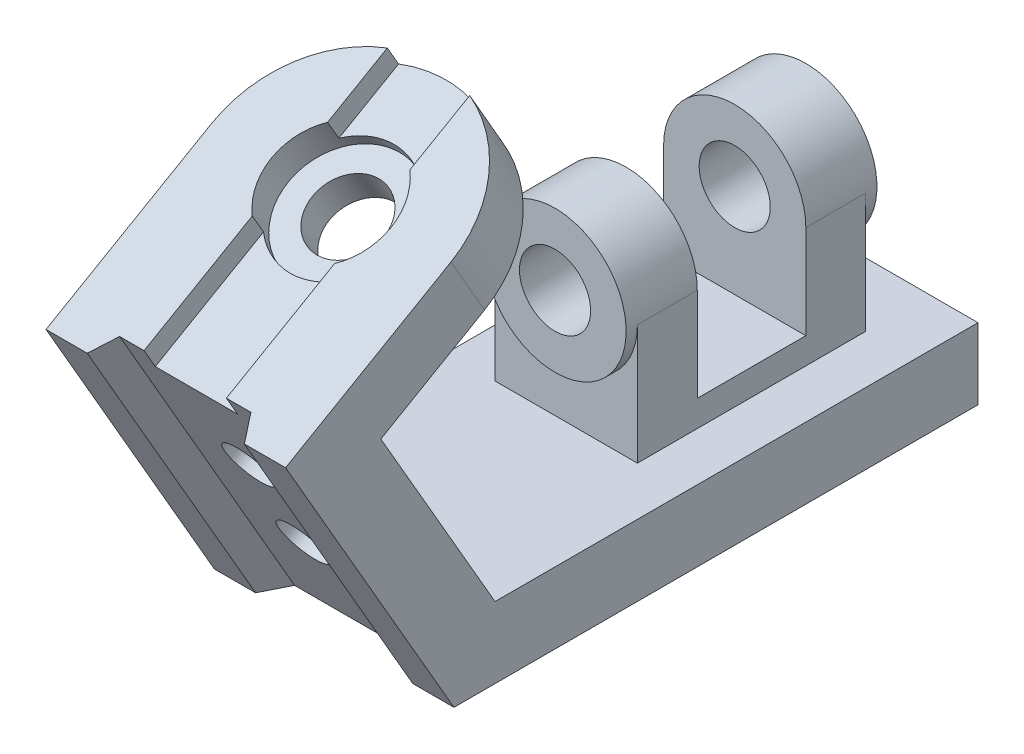
ISO-10303-21;
HEADER;
FILE_DESCRIPTION(('STEP AP214'),'2;1');
FILE_NAME('part.step','',(''),(''),'','','');
FILE_SCHEMA(('AUTOMOTIVE_DESIGN { 1 0 10303 214 1 1 1 1 }'));
ENDSEC;
DATA;
#1=APPLICATION_CONTEXT('core data for automotive mechanical design processes');
#2=APPLICATION_PROTOCOL_DEFINITION('international standard','automotive_design',2000,#1);
#3=PRODUCT_CONTEXT('',#1,'mechanical');
#4=PRODUCT('Part','Part','',(#3));
#5=PRODUCT_RELATED_PRODUCT_CATEGORY('part','',(#4));
#6=PRODUCT_DEFINITION_FORMATION('','',#4);
#7=PRODUCT_DEFINITION_CONTEXT('part definition',#1,'design');
#8=PRODUCT_DEFINITION('design','',#6,#7);
#9=PRODUCT_DEFINITION_SHAPE('','',#8);
#10=(LENGTH_UNIT() NAMED_UNIT(*) SI_UNIT(.MILLI.,.METRE.));
#11=(NAMED_UNIT(*) PLANE_ANGLE_UNIT() SI_UNIT($,.RADIAN.));
#12=(NAMED_UNIT(*) SI_UNIT($,.STERADIAN.) SOLID_ANGLE_UNIT());
#13=UNCERTAINTY_MEASURE_WITH_UNIT(LENGTH_MEASURE(1.E-05),#10,'distance_accuracy_value','');
#14=(GEOMETRIC_REPRESENTATION_CONTEXT(3) GLOBAL_UNCERTAINTY_ASSIGNED_CONTEXT((#13)) GLOBAL_UNIT_ASSIGNED_CONTEXT((#10,
#11,#12)) REPRESENTATION_CONTEXT('',''));
#15=CARTESIAN_POINT('',(0.,0.,0.));
#16=DIRECTION('',(0.,0.,1.));
#17=DIRECTION('',(1.,0.,0.));
#18=AXIS2_PLACEMENT_3D('',#15,#16,#17);
#19=CARTESIAN_POINT('',(0.,51.,-62.));
#20=DIRECTION('',(0.,0.,-1.));
#21=DIRECTION('',(-1.,0.,0.));
#22=AXIS2_PLACEMENT_3D('',#19,#20,#21);
#23=CYLINDRICAL_SURFACE('',#22,19.);
#24=CARTESIAN_POINT('',(0.,51.,-107.));
#25=DIRECTION('',(0.,0.,-1.));
#26=DIRECTION('',(-1.,0.,0.));
#27=AXIS2_PLACEMENT_3D('',#24,#25,#26);
#28=CIRCLE('',#27,19.);
#29=CARTESIAN_POINT('',(19.,51.,-107.));
#30=VERTEX_POINT('',#29);
#31=CARTESIAN_POINT('',(-19.,51.,-107.));
#32=VERTEX_POINT('',#31);
#33=EDGE_CURVE('E254',#30,#32,#28,.F.);
#34=ORIENTED_EDGE('',*,*,#33,.F.);
#35=DIRECTION('',(0.,0.,-1.));
#36=VECTOR('',#35,1.);
#37=CARTESIAN_POINT('',(19.,51.,-62.));
#38=LINE('',#37,#36);
#39=CARTESIAN_POINT('',(19.,51.,-123.));
#40=VERTEX_POINT('',#39);
#41=EDGE_CURVE('E296',#30,#40,#38,.T.);
#42=ORIENTED_EDGE('',*,*,#41,.T.);
#43=CARTESIAN_POINT('',(0.,51.,-123.));
#44=DIRECTION('',(0.,0.,-1.));
#45=DIRECTION('',(-1.,0.,0.));
#46=AXIS2_PLACEMENT_3D('',#43,#44,#45);
#47=CIRCLE('',#46,19.);
#48=CARTESIAN_POINT('',(-19.,51.,-123.));
#49=VERTEX_POINT('',#48);
#50=EDGE_CURVE('E11',#40,#49,#47,.T.);
#51=ORIENTED_EDGE('',*,*,#50,.T.);
#52=DIRECTION('',(0.,0.,-1.));
#53=VECTOR('',#52,1.);
#54=CARTESIAN_POINT('',(-19.,51.,-62.));
#55=LINE('',#54,#53);
#56=EDGE_CURVE('E284',#32,#49,#55,.T.);
#57=ORIENTED_EDGE('',*,*,#56,.F.);
#58=EDGE_LOOP('',(#34,#42,#51,#57));
#59=FACE_BOUND('',#58,.T.);
#60=CARTESIAN_POINT('',(0.,51.,-126.));
#61=DIRECTION('',(0.,0.,-1.));
#62=DIRECTION('',(-1.,0.,0.));
#63=AXIS2_PLACEMENT_3D('',#60,#61,#62);
#64=CIRCLE('',#63,19.);
#65=CARTESIAN_POINT('',(-19.,51.,-126.));
#66=VERTEX_POINT('',#65);
#67=EDGE_CURVE('E266',#66,#66,#64,.T.);
#68=ORIENTED_EDGE('',*,*,#67,.F.);
#69=EDGE_LOOP('',(#68));
#70=FACE_BOUND('',#69,.T.);
#71=ADVANCED_FACE('F32',(#59,#70),#23,.T.);
#72=CARTESIAN_POINT('',(0.,51.,-32.1299423149112));
#73=DIRECTION('',(0.,0.,-1.));
#74=DIRECTION('',(-1.,0.,0.));
#75=AXIS2_PLACEMENT_3D('',#72,#73,#74);
#76=CYLINDRICAL_SURFACE('',#75,9.5);
#77=CARTESIAN_POINT('',(0.,51.,-107.));
#78=DIRECTION('',(0.,0.,-1.));
#79=DIRECTION('',(-1.,0.,0.));
#80=AXIS2_PLACEMENT_3D('',#77,#78,#79);
#81=CIRCLE('',#80,9.5);
#82=CARTESIAN_POINT('',(-9.5,51.,-107.));
#83=VERTEX_POINT('',#82);
#84=EDGE_CURVE('E36',#83,#83,#81,.F.);
#85=ORIENTED_EDGE('',*,*,#84,.T.);
#86=EDGE_LOOP('',(#85));
#87=FACE_BOUND('',#86,.T.);
#88=CARTESIAN_POINT('',(0.,51.,-126.));
#89=DIRECTION('',(0.,0.,-1.));
#90=DIRECTION('',(-1.,0.,0.));
#91=AXIS2_PLACEMENT_3D('',#88,#89,#90);
#92=CIRCLE('',#91,9.5);
#93=CARTESIAN_POINT('',(-9.5,51.,-126.));
#94=VERTEX_POINT('',#93);
#95=EDGE_CURVE('E260',#94,#94,#92,.T.);
#96=ORIENTED_EDGE('',*,*,#95,.T.);
#97=EDGE_LOOP('',(#96));
#98=FACE_BOUND('',#97,.T.);
#99=ADVANCED_FACE('F476',(#87,#98),#76,.F.);
#100=CARTESIAN_POINT('',(32.,19.,-201.566981764822));
#101=DIRECTION('',(0.,-1.,0.));
#102=DIRECTION('',(0.,0.,-1.));
#103=AXIS2_PLACEMENT_3D('',#100,#101,#102);
#104=PLANE('',#103);
#105=DIRECTION('',(0.,0.,1.));
#106=VECTOR('',#105,1.);
#107=CARTESIAN_POINT('',(-32.,19.,-201.566981764822));
#108=LINE('',#107,#106);
#109=CARTESIAN_POINT('',(-32.,19.,-140.));
#110=VERTEX_POINT('',#109);
#111=CARTESIAN_POINT('',(-32.,19.,-10.9696551146029));
#112=VERTEX_POINT('',#111);
#113=EDGE_CURVE('E433',#110,#112,#108,.T.);
#114=ORIENTED_EDGE('',*,*,#113,.T.);
#115=DIRECTION('',(-1.,0.,0.));
#116=VECTOR('',#115,1.);
#117=CARTESIAN_POINT('',(32.,19.,-10.9696551146029));
#118=LINE('',#117,#116);
#119=CARTESIAN_POINT('',(32.,19.,-10.9696551146029));
#120=VERTEX_POINT('',#119);
#121=EDGE_CURVE('E443',#120,#112,#118,.T.);
#122=ORIENTED_EDGE('',*,*,#121,.F.);
#123=DIRECTION('',(0.,0.,1.));
#124=VECTOR('',#123,1.);
#125=CARTESIAN_POINT('',(32.,19.,-201.566981764822));
#126=LINE('',#125,#124);
#127=CARTESIAN_POINT('',(32.,19.,-140.));
#128=VERTEX_POINT('',#127);
#129=EDGE_CURVE('E419',#128,#120,#126,.T.);
#130=ORIENTED_EDGE('',*,*,#129,.F.);
#131=DIRECTION('',(-1.,0.,0.));
#132=VECTOR('',#131,1.);
#133=CARTESIAN_POINT('',(32.,19.,-140.));
#134=LINE('',#133,#132);
#135=EDGE_CURVE('E446',#128,#110,#134,.T.);
#136=ORIENTED_EDGE('',*,*,#135,.T.);
#137=EDGE_LOOP('',(#114,#122,#130,#136));
#138=FACE_BOUND('',#137,.T.);
#139=DIRECTION('',(-1.,0.,0.));
#140=VECTOR('',#139,1.);
#141=CARTESIAN_POINT('',(-49.6108563641288,19.,-62.));
#142=LINE('',#141,#140);
#143=CARTESIAN_POINT('',(19.,19.,-62.));
#144=VERTEX_POINT('',#143);
#145=CARTESIAN_POINT('',(-19.,19.,-62.));
#146=VERTEX_POINT('',#145);
#147=EDGE_CURVE('E281',#144,#146,#142,.T.);
#148=ORIENTED_EDGE('',*,*,#147,.T.);
#149=DIRECTION('',(0.,0.,-1.));
#150=VECTOR('',#149,1.);
#151=CARTESIAN_POINT('',(-19.,19.,-62.));
#152=LINE('',#151,#150);
#153=CARTESIAN_POINT('',(-19.,19.,-123.));
#154=VERTEX_POINT('',#153);
#155=EDGE_CURVE('E288',#146,#154,#152,.T.);
#156=ORIENTED_EDGE('',*,*,#155,.T.);
#157=DIRECTION('',(-1.,0.,0.));
#158=VECTOR('',#157,1.);
#159=CARTESIAN_POINT('',(-49.6108563641288,19.,-123.));
#160=LINE('',#159,#158);
#161=CARTESIAN_POINT('',(19.,19.,-123.));
#162=VERTEX_POINT('',#161);
#163=EDGE_CURVE('E278',#162,#154,#160,.T.);
#164=ORIENTED_EDGE('',*,*,#163,.F.);
#165=DIRECTION('',(0.,0.,-1.));
#166=VECTOR('',#165,1.);
#167=CARTESIAN_POINT('',(19.,19.,-62.));
#168=LINE('',#167,#166);
#169=EDGE_CURVE('E292',#144,#162,#168,.T.);
#170=ORIENTED_EDGE('',*,*,#169,.F.);
#171=EDGE_LOOP('',(#148,#156,#164,#170));
#172=FACE_BOUND('',#171,.T.);
#173=ADVANCED_FACE('F483',(#138,#172),#104,.F.);
#174=CARTESIAN_POINT('',(11.,96.4202115404301,0.995294735436678));
#175=DIRECTION('',(-1.,0.,0.));
#176=DIRECTION('',(0.,0.,1.));
#177=AXIS2_PLACEMENT_3D('',#174,#175,#176);
#178=PLANE('',#177);
#179=DIRECTION('',(0.,0.866025403784436,0.500000000000004));
#180=VECTOR('',#179,1.);
#181=CARTESIAN_POINT('',(11.,89.8385826872284,6.3950103057431));
#182=LINE('',#181,#180);
#183=CARTESIAN_POINT('',(11.,92.4366588985817,7.89501030574314));
#184=VERTEX_POINT('',#183);
#185=CARTESIAN_POINT('',(11.,97.6328113212883,10.8950103057431));
#186=VERTEX_POINT('',#185);
#187=EDGE_CURVE('E322',#184,#186,#182,.T.);
#188=ORIENTED_EDGE('',*,*,#187,.F.);
#189=DIRECTION('',(0.,-0.500000000000004,0.866025403784436));
#190=VECTOR('',#189,1.);
#191=CARTESIAN_POINT('',(11.,96.4202115404301,0.995294735436678));
#192=LINE('',#191,#190);
#193=CARTESIAN_POINT('',(11.,75.7461339178927,36.8038475772938));
#194=VERTEX_POINT('',#193);
#195=EDGE_CURVE('E341',#184,#194,#192,.T.);
#196=ORIENTED_EDGE('',*,*,#195,.T.);
#197=DIRECTION('',(0.,0.866025403784436,0.500000000000004));
#198=VECTOR('',#197,1.);
#199=CARTESIAN_POINT('',(11.,75.7461339178927,36.8038475772938));
#200=LINE('',#199,#198);
#201=CARTESIAN_POINT('',(11.,80.9422863405993,39.8038475772938));
#202=VERTEX_POINT('',#201);
#203=EDGE_CURVE('E356',#194,#202,#200,.T.);
#204=ORIENTED_EDGE('',*,*,#203,.T.);
#205=DIRECTION('',(0.,-0.500000000000004,0.866025403784436));
#206=VECTOR('',#205,1.);
#207=CARTESIAN_POINT('',(11.,101.616363963137,3.9952947354367));
#208=LINE('',#207,#206);
#209=EDGE_CURVE('E349',#186,#202,#208,.T.);
#210=ORIENTED_EDGE('',*,*,#209,.F.);
#211=EDGE_LOOP('',(#188,#196,#204,#210));
#212=FACE_BOUND('',#211,.T.);
#213=ADVANCED_FACE('F564',(#212),#178,.T.);
#214=CARTESIAN_POINT('',(-11.,96.4202115404301,0.995294735436677));
#215=DIRECTION('',(-1.,0.,0.));
#216=DIRECTION('',(0.,0.,1.));
#217=AXIS2_PLACEMENT_3D('',#214,#215,#216);
#218=PLANE('',#217);
#219=DIRECTION('',(0.,-0.500000000000004,0.866025403784436));
#220=VECTOR('',#219,1.);
#221=CARTESIAN_POINT('',(-11.,96.4202115404301,0.995294735436677));
#222=LINE('',#221,#220);
#223=CARTESIAN_POINT('',(-11.,92.4366588985817,7.89501030574314));
#224=VERTEX_POINT('',#223);
#225=CARTESIAN_POINT('',(-11.,75.7461339178927,36.8038475772938));
#226=VERTEX_POINT('',#225);
#227=EDGE_CURVE('E333',#224,#226,#222,.T.);
#228=ORIENTED_EDGE('',*,*,#227,.F.);
#229=DIRECTION('',(0.,0.866025403784436,0.500000000000004));
#230=VECTOR('',#229,1.);
#231=CARTESIAN_POINT('',(-11.,89.8385826872284,6.3950103057431));
#232=LINE('',#231,#230);
#233=CARTESIAN_POINT('',(-11.,97.6328113212883,10.8950103057431));
#234=VERTEX_POINT('',#233);
#235=EDGE_CURVE('E57',#224,#234,#232,.T.);
#236=ORIENTED_EDGE('',*,*,#235,.T.);
#237=DIRECTION('',(0.,-0.500000000000004,0.866025403784436));
#238=VECTOR('',#237,1.);
#239=CARTESIAN_POINT('',(-11.,101.616363963137,3.9952947354367));
#240=LINE('',#239,#238);
#241=CARTESIAN_POINT('',(-11.,80.9422863405993,39.8038475772938));
#242=VERTEX_POINT('',#241);
#243=EDGE_CURVE('E329',#234,#242,#240,.T.);
#244=ORIENTED_EDGE('',*,*,#243,.T.);
#245=DIRECTION('',(0.,0.866025403784436,0.500000000000004));
#246=VECTOR('',#245,1.);
#247=CARTESIAN_POINT('',(-11.,75.7461339178927,36.8038475772938));
#248=LINE('',#247,#246);
#249=EDGE_CURVE('E359',#226,#242,#248,.T.);
#250=ORIENTED_EDGE('',*,*,#249,.F.);
#251=EDGE_LOOP('',(#228,#236,#244,#250));
#252=FACE_BOUND('',#251,.T.);
#253=ADVANCED_FACE('F568',(#252),#218,.F.);
#254=CARTESIAN_POINT('',(-81.4542947755958,96.4202115404301,0.995294735436675));
#255=DIRECTION('',(0.,0.866025403784436,0.500000000000004));
#256=DIRECTION('',(0.,-0.500000000000004,0.866025403784436));
#257=AXIS2_PLACEMENT_3D('',#254,#255,#256);
#258=PLANE('',#257);
#259=CARTESIAN_POINT('',(0.,98.2461339178929,-2.16729559300588));
#260=DIRECTION('',(0.,0.866025403784436,0.500000000000004));
#261=DIRECTION('',(0.,-0.500000000000004,0.866025403784436));
#262=AXIS2_PLACEMENT_3D('',#259,#260,#261);
#263=CIRCLE('',#262,16.);
#264=CARTESIAN_POINT('',(11.,104.055608937204,-12.2296014917549));
#265=VERTEX_POINT('',#264);
#266=CARTESIAN_POINT('',(-11.,104.055608937204,-12.2296014917549));
#267=VERTEX_POINT('',#266);
#268=EDGE_CURVE('E41',#265,#267,#263,.T.);
#269=ORIENTED_EDGE('',*,*,#268,.F.);
#270=CARTESIAN_POINT('',(11.,113.27111311921,-28.191322952352));
#271=VERTEX_POINT('',#270);
#272=EDGE_CURVE('E342',#271,#265,#192,.T.);
#273=ORIENTED_EDGE('',*,*,#272,.F.);
#274=CARTESIAN_POINT('',(0.,98.2461339178929,-2.16729559300587));
#275=DIRECTION('',(0.,0.866025403784436,0.500000000000004));
#276=DIRECTION('',(0.,-0.500000000000004,0.866025403784436));
#277=AXIS2_PLACEMENT_3D('',#274,#275,#276);
#278=CIRCLE('',#277,32.);
#279=CARTESIAN_POINT('',(-11.,113.27111311921,-28.191322952352));
#280=VERTEX_POINT('',#279);
#281=EDGE_CURVE('E330',#271,#280,#278,.T.);
#282=ORIENTED_EDGE('',*,*,#281,.T.);
#283=EDGE_CURVE('E335',#280,#267,#222,.T.);
#284=ORIENTED_EDGE('',*,*,#283,.T.);
#285=EDGE_LOOP('',(#269,#273,#282,#284));
#286=FACE_BOUND('',#285,.T.);
#287=ADVANCED_FACE('F558',(#286),#258,.T.);
#288=CARTESIAN_POINT('',(32.,170.309231500771,-114.984241957343));
#289=DIRECTION('',(0.,0.866025403784436,0.500000000000004));
#290=DIRECTION('',(0.,-0.500000000000004,0.866025403784436));
#291=AXIS2_PLACEMENT_3D('',#288,#289,#290);
#292=PLANE('',#291);
#293=CARTESIAN_POINT('',(0.,103.442286340599,0.832704406994116));
#294=DIRECTION('',(0.,0.866025403784436,0.500000000000004));
#295=DIRECTION('',(0.,-0.500000000000004,0.866025403784436));
#296=AXIS2_PLACEMENT_3D('',#293,#294,#295);
#297=CIRCLE('',#296,16.);
#298=CARTESIAN_POINT('',(11.,109.251761359911,-9.22960149175491));
#299=VERTEX_POINT('',#298);
#300=EDGE_CURVE('E318',#186,#299,#297,.T.);
#301=ORIENTED_EDGE('',*,*,#300,.F.);
#302=ORIENTED_EDGE('',*,*,#209,.T.);
#303=DIRECTION('',(-1.,0.,0.));
#304=VECTOR('',#303,1.);
#305=CARTESIAN_POINT('',(-17.5358983848622,80.9422863405993,39.8038475772938));
#306=LINE('',#305,#304);
#307=CARTESIAN_POINT('',(17.5358983848622,80.9422863405993,39.8038475772938));
#308=VERTEX_POINT('',#307);
#309=EDGE_CURVE('E366',#308,#202,#306,.T.);
#310=ORIENTED_EDGE('',*,*,#309,.F.);
#311=DIRECTION('',(-0.500000000000005,0.433012701892221,-0.749999999999995));
#312=VECTOR('',#311,1.);
#313=CARTESIAN_POINT('',(17.5358983848622,80.9422863405993,39.8038475772938));
#314=LINE('',#313,#312);
#315=CARTESIAN_POINT('',(21.,77.9422863405993,45.0000000000004));
#316=VERTEX_POINT('',#315);
#317=EDGE_CURVE('E355',#316,#308,#314,.T.);
#318=ORIENTED_EDGE('',*,*,#317,.F.);
#319=DIRECTION('',(-1.,0.,0.));
#320=VECTOR('',#319,1.);
#321=CARTESIAN_POINT('',(32.,77.9422863405992,45.0000000000004));
#322=LINE('',#321,#320);
#323=CARTESIAN_POINT('',(32.,77.9422863405992,45.0000000000004));
#324=VERTEX_POINT('',#323);
#325=EDGE_CURVE('E440',#324,#316,#322,.T.);
#326=ORIENTED_EDGE('',*,*,#325,.F.);
#327=DIRECTION('',(0.,0.500000000000004,-0.866025403784436));
#328=VECTOR('',#327,1.);
#329=CARTESIAN_POINT('',(32.,170.309231500771,-114.984241957343));
#330=LINE('',#329,#328);
#331=CARTESIAN_POINT('',(32.,103.442286340599,0.83270440699411));
#332=VERTEX_POINT('',#331);
#333=EDGE_CURVE('E424',#324,#332,#330,.T.);
#334=ORIENTED_EDGE('',*,*,#333,.T.);
#335=CARTESIAN_POINT('',(0.,103.442286340599,0.832704406994123));
#336=DIRECTION('',(0.,0.866025403784436,0.500000000000004));
#337=DIRECTION('',(0.,-0.500000000000004,0.866025403784436));
#338=AXIS2_PLACEMENT_3D('',#335,#336,#337);
#339=CIRCLE('',#338,32.);
#340=CARTESIAN_POINT('',(11.,118.467265541916,-25.191322952352));
#341=VERTEX_POINT('',#340);
#342=EDGE_CURVE('E394',#332,#341,#339,.T.);
#343=ORIENTED_EDGE('',*,*,#342,.T.);
#344=EDGE_CURVE('E334',#341,#299,#208,.T.);
#345=ORIENTED_EDGE('',*,*,#344,.T.);
#346=EDGE_LOOP('',(#301,#302,#310,#318,#326,#334,#343,#345));
#347=FACE_BOUND('',#346,.T.);
#348=ADVANCED_FACE('F589',(#347),#292,.T.);
#349=CARTESIAN_POINT('',(0.,87.8538290724796,-8.16729559300595));
#350=DIRECTION('',(0.,0.866025403784436,0.500000000000004));
#351=DIRECTION('',(0.,-0.500000000000004,0.866025403784436));
#352=AXIS2_PLACEMENT_3D('',#349,#350,#351);
#353=CYLINDRICAL_SURFACE('',#352,32.);
#354=ORIENTED_EDGE('',*,*,#281,.F.);
#355=DIRECTION('',(0.,0.866025403784436,0.500000000000004));
#356=VECTOR('',#355,1.);
#357=CARTESIAN_POINT('',(11.,113.27111311921,-28.191322952352));
#358=LINE('',#357,#356);
#359=EDGE_CURVE('E352',#271,#341,#358,.T.);
#360=ORIENTED_EDGE('',*,*,#359,.T.);
#361=ORIENTED_EDGE('',*,*,#342,.F.);
#362=DIRECTION('',(0.,0.866025403784436,0.500000000000004));
#363=VECTOR('',#362,1.);
#364=CARTESIAN_POINT('',(32.,87.8538290724796,-8.16729559300596));
#365=LINE('',#364,#363);
#366=CARTESIAN_POINT('',(32.,87.8538290724796,-8.16729559300596));
#367=VERTEX_POINT('',#366);
#368=EDGE_CURVE('E400',#367,#332,#365,.T.);
#369=ORIENTED_EDGE('',*,*,#368,.F.);
#370=CARTESIAN_POINT('',(0.,87.8538290724796,-8.16729559300595));
#371=DIRECTION('',(0.,0.866025403784436,0.500000000000004));
#372=DIRECTION('',(0.,-0.500000000000004,0.866025403784436));
#373=AXIS2_PLACEMENT_3D('',#370,#371,#372);
#374=CIRCLE('',#373,32.);
#375=CARTESIAN_POINT('',(-32.,87.8538290724796,-8.16729559300594));
#376=VERTEX_POINT('',#375);
#377=EDGE_CURVE('E393',#367,#376,#374,.T.);
#378=ORIENTED_EDGE('',*,*,#377,.T.);
#379=DIRECTION('',(0.,0.866025403784436,0.500000000000004));
#380=VECTOR('',#379,1.);
#381=CARTESIAN_POINT('',(-32.,87.8538290724796,-8.16729559300594));
#382=LINE('',#381,#380);
#383=CARTESIAN_POINT('',(-32.,103.442286340599,0.832704406994133));
#384=VERTEX_POINT('',#383);
#385=EDGE_CURVE('E403',#376,#384,#382,.T.);
#386=ORIENTED_EDGE('',*,*,#385,.T.);
#387=CARTESIAN_POINT('',(-11.,118.467265541916,-25.191322952352));
#388=VERTEX_POINT('',#387);
#389=EDGE_CURVE('E390',#388,#384,#339,.T.);
#390=ORIENTED_EDGE('',*,*,#389,.F.);
#391=DIRECTION('',(0.,0.866025403784436,0.500000000000004));
#392=VECTOR('',#391,1.);
#393=CARTESIAN_POINT('',(-11.,113.27111311921,-28.191322952352));
#394=LINE('',#393,#392);
#395=EDGE_CURVE('E345',#280,#388,#394,.T.);
#396=ORIENTED_EDGE('',*,*,#395,.F.);
#397=EDGE_LOOP('',(#354,#360,#361,#369,#378,#386,#390,#396));
#398=FACE_BOUND('',#397,.T.);
#399=ADVANCED_FACE('F578',(#398),#353,.T.);
#400=CARTESIAN_POINT('',(-17.5358983848622,-57.6217782649111,-40.1961524227072));
#401=DIRECTION('',(0.,0.500000000000004,-0.866025403784436));
#402=DIRECTION('',(0.,0.866025403784436,0.500000000000004));
#403=AXIS2_PLACEMENT_3D('',#400,#401,#402);
#404=PLANE('',#403);
#405=CARTESIAN_POINT('',(0.,26.3826859021799,8.30384757729353));
#406=DIRECTION('',(0.,-0.500000000000004,0.866025403784436));
#407=DIRECTION('',(0.,-0.866025403784436,-0.500000000000004));
#408=AXIS2_PLACEMENT_3D('',#405,#406,#407);
#409=CIRCLE('',#408,6.5);
#410=CARTESIAN_POINT('',(0.,20.753520777581,5.0538475772935));
#411=VERTEX_POINT('',#410);
#412=EDGE_CURVE('E291',#411,#411,#409,.T.);
#413=ORIENTED_EDGE('',*,*,#412,.F.);
#414=EDGE_LOOP('',(#413));
#415=FACE_BOUND('',#414,.T.);
#416=CARTESIAN_POINT('',(0.,51.4974226119285,22.8038475772937));
#417=DIRECTION('',(0.,-0.500000000000004,0.866025403784436));
#418=DIRECTION('',(0.,-0.866025403784436,-0.500000000000004));
#419=AXIS2_PLACEMENT_3D('',#416,#417,#418);
#420=CIRCLE('',#419,6.5);
#421=CARTESIAN_POINT('',(0.,45.8682574873297,19.5538475772936));
#422=VERTEX_POINT('',#421);
#423=EDGE_CURVE('E305',#422,#422,#420,.T.);
#424=ORIENTED_EDGE('',*,*,#423,.F.);
#425=EDGE_LOOP('',(#424));
#426=FACE_BOUND('',#425,.T.);
#427=ORIENTED_EDGE('',*,*,#203,.F.);
#428=DIRECTION('',(1.,0.,0.));
#429=VECTOR('',#428,1.);
#430=CARTESIAN_POINT('',(-81.4542947755958,75.7461339178927,36.8038475772938));
#431=LINE('',#430,#429);
#432=EDGE_CURVE('E338',#226,#194,#431,.T.);
#433=ORIENTED_EDGE('',*,*,#432,.F.);
#434=ORIENTED_EDGE('',*,*,#249,.T.);
#435=CARTESIAN_POINT('',(-17.5358983848622,80.9422863405993,39.8038475772938));
#436=VERTEX_POINT('',#435);
#437=EDGE_CURVE('E365',#242,#436,#306,.T.);
#438=ORIENTED_EDGE('',*,*,#437,.T.);
#439=DIRECTION('',(0.,0.866025403784436,0.500000000000004));
#440=VECTOR('',#439,1.);
#441=CARTESIAN_POINT('',(-17.5358983848622,-57.6217782649111,-40.1961524227072));
#442=LINE('',#441,#440);
#443=CARTESIAN_POINT('',(-17.5358983848622,0.,-6.92820323027553));
#444=VERTEX_POINT('',#443);
#445=EDGE_CURVE('E376',#444,#436,#442,.T.);
#446=ORIENTED_EDGE('',*,*,#445,.F.);
#447=DIRECTION('',(-1.,0.,0.));
#448=VECTOR('',#447,1.);
#449=CARTESIAN_POINT('',(32.,0.,-6.92820323027554));
#450=LINE('',#449,#448);
#451=CARTESIAN_POINT('',(17.5358983848622,0.,-6.92820323027555));
#452=VERTEX_POINT('',#451);
#453=EDGE_CURVE('E384',#452,#444,#450,.T.);
#454=ORIENTED_EDGE('',*,*,#453,.F.);
#455=DIRECTION('',(0.,0.866025403784436,0.500000000000004));
#456=VECTOR('',#455,1.);
#457=CARTESIAN_POINT('',(17.5358983848622,-57.6217782649111,-40.1961524227072));
#458=LINE('',#457,#456);
#459=EDGE_CURVE('E379',#452,#308,#458,.T.);
#460=ORIENTED_EDGE('',*,*,#459,.T.);
#461=ORIENTED_EDGE('',*,*,#309,.T.);
#462=EDGE_LOOP('',(#427,#433,#434,#438,#446,#454,#460,#461));
#463=FACE_BOUND('',#462,.T.);
#464=ADVANCED_FACE('F574',(#415,#426,#463),#404,.F.);
#465=CARTESIAN_POINT('',(32.,-72.0234180644682,-41.5827398074781));
#466=DIRECTION('',(0.,-0.500000000000004,0.866025403784436));
#467=DIRECTION('',(0.,-0.866025403784436,-0.500000000000004));
#468=AXIS2_PLACEMENT_3D('',#465,#466,#467);
#469=PLANE('',#468);
#470=DIRECTION('',(0.,0.866025403784436,0.500000000000004));
#471=VECTOR('',#470,1.);
#472=CARTESIAN_POINT('',(-21.,-60.6217782649111,-35.0000000000006));
#473=LINE('',#472,#471);
#474=CARTESIAN_POINT('',(-21.,0.,0.));
#475=VERTEX_POINT('',#474);
#476=CARTESIAN_POINT('',(-21.,77.9422863405993,45.0000000000004));
#477=VERTEX_POINT('',#476);
#478=EDGE_CURVE('E372',#475,#477,#473,.T.);
#479=ORIENTED_EDGE('',*,*,#478,.T.);
#480=CARTESIAN_POINT('',(-32.,77.9422863405992,45.0000000000004));
#481=VERTEX_POINT('',#480);
#482=EDGE_CURVE('E426',#477,#481,#322,.T.);
#483=ORIENTED_EDGE('',*,*,#482,.T.);
#484=DIRECTION('',(0.,0.866025403784436,0.500000000000004));
#485=VECTOR('',#484,1.);
#486=CARTESIAN_POINT('',(-32.,-72.0234180644682,-41.5827398074781));
#487=LINE('',#486,#485);
#488=CARTESIAN_POINT('',(-32.,0.,0.));
#489=VERTEX_POINT('',#488);
#490=EDGE_CURVE('E411',#489,#481,#487,.T.);
#491=ORIENTED_EDGE('',*,*,#490,.F.);
#492=DIRECTION('',(-1.,0.,0.));
#493=VECTOR('',#492,1.);
#494=CARTESIAN_POINT('',(32.,0.,0.));
#495=LINE('',#494,#493);
#496=EDGE_CURVE('E452',#475,#489,#495,.T.);
#497=ORIENTED_EDGE('',*,*,#496,.F.);
#498=EDGE_LOOP('',(#479,#483,#491,#497));
#499=FACE_BOUND('',#498,.T.);
#500=ADVANCED_FACE('F577',(#499),#469,.T.);
#501=CARTESIAN_POINT('',(32.,-62.5234180644681,-58.0372224793825));
#502=DIRECTION('',(0.,0.500000000000004,-0.866025403784436));
#503=DIRECTION('',(0.,0.866025403784436,0.500000000000004));
#504=AXIS2_PLACEMENT_3D('',#501,#502,#503);
#505=PLANE('',#504);
#506=CARTESIAN_POINT('',(0.,32.8826859021799,-2.95448267190416));
#507=DIRECTION('',(0.,0.500000000000004,-0.866025403784436));
#508=DIRECTION('',(0.,0.866025403784436,0.500000000000004));
#509=AXIS2_PLACEMENT_3D('',#506,#507,#508);
#510=CIRCLE('',#509,6.5);
#511=CARTESIAN_POINT('',(0.,38.5118510267788,0.295517328095869));
#512=VERTEX_POINT('',#511);
#513=EDGE_CURVE('E302',#512,#512,#510,.F.);
#514=ORIENTED_EDGE('',*,*,#513,.T.);
#515=EDGE_LOOP('',(#514));
#516=FACE_BOUND('',#515,.T.);
#517=CARTESIAN_POINT('',(0.,57.9974226119286,11.545517328096));
#518=DIRECTION('',(0.,0.500000000000004,-0.866025403784436));
#519=DIRECTION('',(0.,0.866025403784436,0.500000000000004));
#520=AXIS2_PLACEMENT_3D('',#517,#518,#519);
#521=CIRCLE('',#520,6.5);
#522=CARTESIAN_POINT('',(0.,63.6265877365274,14.795517328096));
#523=VERTEX_POINT('',#522);
#524=EDGE_CURVE('E308',#523,#523,#521,.F.);
#525=ORIENTED_EDGE('',*,*,#524,.T.);
#526=EDGE_LOOP('',(#525));
#527=FACE_BOUND('',#526,.T.);
#528=DIRECTION('',(0.,-0.866025403784436,-0.500000000000005));
#529=VECTOR('',#528,1.);
#530=CARTESIAN_POINT('',(-32.,-62.5234180644681,-58.0372224793825));
#531=LINE('',#530,#529);
#532=CARTESIAN_POINT('',(-32.,71.8538290724795,19.545517328096));
#533=VERTEX_POINT('',#532);
#534=EDGE_CURVE('E436',#533,#112,#531,.T.);
#535=ORIENTED_EDGE('',*,*,#534,.F.);
#536=DIRECTION('',(1.,0.,0.));
#537=VECTOR('',#536,1.);
#538=CARTESIAN_POINT('',(32.,71.8538290724795,19.545517328096));
#539=LINE('',#538,#537);
#540=CARTESIAN_POINT('',(32.,71.8538290724795,19.545517328096));
#541=VERTEX_POINT('',#540);
#542=EDGE_CURVE('E406',#533,#541,#539,.T.);
#543=ORIENTED_EDGE('',*,*,#542,.T.);
#544=DIRECTION('',(0.,-0.866025403784436,-0.500000000000005));
#545=VECTOR('',#544,1.);
#546=CARTESIAN_POINT('',(32.,-62.5234180644681,-58.0372224793825));
#547=LINE('',#546,#545);
#548=EDGE_CURVE('E422',#541,#120,#547,.T.);
#549=ORIENTED_EDGE('',*,*,#548,.T.);
#550=ORIENTED_EDGE('',*,*,#121,.T.);
#551=EDGE_LOOP('',(#535,#543,#549,#550));
#552=FACE_BOUND('',#551,.T.);
#553=ADVANCED_FACE('F603',(#516,#527,#552),#505,.T.);
#554=DIRECTION('',(0.,0.866025403784436,0.500000000000004));
#555=VECTOR('',#554,1.);
#556=CARTESIAN_POINT('',(21.,-60.6217782649111,-35.0000000000006));
#557=LINE('',#556,#555);
#558=CARTESIAN_POINT('',(21.,0.,0.));
#559=VERTEX_POINT('',#558);
#560=EDGE_CURVE('E371',#559,#316,#557,.T.);
#561=ORIENTED_EDGE('',*,*,#560,.F.);
#562=CARTESIAN_POINT('',(32.,0.,0.));
#563=VERTEX_POINT('',#562);
#564=EDGE_CURVE('E453',#563,#559,#495,.T.);
#565=ORIENTED_EDGE('',*,*,#564,.F.);
#566=DIRECTION('',(0.,0.866025403784436,0.500000000000004));
#567=VECTOR('',#566,1.);
#568=CARTESIAN_POINT('',(32.,-72.0234180644682,-41.5827398074781));
#569=LINE('',#568,#567);
#570=EDGE_CURVE('E412',#563,#324,#569,.T.);
#571=ORIENTED_EDGE('',*,*,#570,.T.);
#572=ORIENTED_EDGE('',*,*,#325,.T.);
#573=EDGE_LOOP('',(#561,#565,#571,#572));
#574=FACE_BOUND('',#573,.T.);
#575=ADVANCED_FACE('F34',(#574),#469,.T.);
#576=CARTESIAN_POINT('',(32.,0.,-201.566981764822));
#577=DIRECTION('',(0.,1.,0.));
#578=DIRECTION('',(0.,0.,1.));
#579=AXIS2_PLACEMENT_3D('',#576,#577,#578);
#580=PLANE('',#579);
#581=ORIENTED_EDGE('',*,*,#453,.T.);
#582=DIRECTION('',(-0.447213595499962,0.,0.894427190999914));
#583=VECTOR('',#582,1.);
#584=CARTESIAN_POINT('',(70.2267927059294,0.,-182.453585411857));
#585=LINE('',#584,#583);
#586=EDGE_CURVE('E387',#444,#475,#585,.T.);
#587=ORIENTED_EDGE('',*,*,#586,.T.);
#588=ORIENTED_EDGE('',*,*,#496,.T.);
#589=DIRECTION('',(0.,0.,-1.));
#590=VECTOR('',#589,1.);
#591=CARTESIAN_POINT('',(-32.,0.,-201.566981764822));
#592=LINE('',#591,#590);
#593=CARTESIAN_POINT('',(-32.,0.,-140.));
#594=VERTEX_POINT('',#593);
#595=EDGE_CURVE('E429',#489,#594,#592,.T.);
#596=ORIENTED_EDGE('',*,*,#595,.T.);
#597=DIRECTION('',(-1.,0.,0.));
#598=VECTOR('',#597,1.);
#599=CARTESIAN_POINT('',(32.,0.,-140.));
#600=LINE('',#599,#598);
#601=CARTESIAN_POINT('',(32.,0.,-140.));
#602=VERTEX_POINT('',#601);
#603=EDGE_CURVE('E449',#602,#594,#600,.T.);
#604=ORIENTED_EDGE('',*,*,#603,.F.);
#605=DIRECTION('',(0.,0.,-1.));
#606=VECTOR('',#605,1.);
#607=CARTESIAN_POINT('',(32.,0.,-201.566981764822));
#608=LINE('',#607,#606);
#609=EDGE_CURVE('E414',#563,#602,#608,.T.);
#610=ORIENTED_EDGE('',*,*,#609,.F.);
#611=ORIENTED_EDGE('',*,*,#564,.T.);
#612=DIRECTION('',(-0.447213595499962,0.,-0.894427190999914));
#613=VECTOR('',#612,1.);
#614=CARTESIAN_POINT('',(-57.4267927059293,0.,-156.853585411857));
#615=LINE('',#614,#613);
#616=EDGE_CURVE('E375',#559,#452,#615,.T.);
#617=ORIENTED_EDGE('',*,*,#616,.T.);
#618=EDGE_LOOP('',(#581,#587,#588,#596,#604,#610,#611,#617));
#619=FACE_BOUND('',#618,.T.);
#620=ADVANCED_FACE('F611',(#619),#580,.F.);
#621=CARTESIAN_POINT('',(32.,20.3435270957035,-140.));
#622=DIRECTION('',(0.,0.,1.));
#623=DIRECTION('',(1.,0.,0.));
#624=AXIS2_PLACEMENT_3D('',#621,#622,#623);
#625=PLANE('',#624);
#626=DIRECTION('',(0.,1.,0.));
#627=VECTOR('',#626,1.);
#628=CARTESIAN_POINT('',(-32.,20.3435270957035,-140.));
#629=LINE('',#628,#627);
#630=EDGE_CURVE('E431',#594,#110,#629,.T.);
#631=ORIENTED_EDGE('',*,*,#630,.T.);
#632=ORIENTED_EDGE('',*,*,#135,.F.);
#633=DIRECTION('',(0.,1.,0.));
#634=VECTOR('',#633,1.);
#635=CARTESIAN_POINT('',(32.,20.3435270957035,-140.));
#636=LINE('',#635,#634);
#637=EDGE_CURVE('E417',#602,#128,#636,.T.);
#638=ORIENTED_EDGE('',*,*,#637,.F.);
#639=ORIENTED_EDGE('',*,*,#603,.T.);
#640=EDGE_LOOP('',(#631,#632,#638,#639));
#641=FACE_BOUND('',#640,.T.);
#642=ADVANCED_FACE('F601',(#641),#625,.F.);
#643=CARTESIAN_POINT('',(-11.,109.251761359911,-9.22960149175491));
#644=VERTEX_POINT('',#643);
#645=EDGE_CURVE('E320',#644,#234,#297,.T.);
#646=ORIENTED_EDGE('',*,*,#645,.F.);
#647=EDGE_CURVE('E346',#388,#644,#240,.T.);
#648=ORIENTED_EDGE('',*,*,#647,.F.);
#649=ORIENTED_EDGE('',*,*,#389,.T.);
#650=DIRECTION('',(0.,0.500000000000004,-0.866025403784436));
#651=VECTOR('',#650,1.);
#652=CARTESIAN_POINT('',(-32.,170.309231500771,-114.984241957343));
#653=LINE('',#652,#651);
#654=EDGE_CURVE('E415',#481,#384,#653,.T.);
#655=ORIENTED_EDGE('',*,*,#654,.F.);
#656=ORIENTED_EDGE('',*,*,#482,.F.);
#657=DIRECTION('',(-0.500000000000005,-0.433012701892221,0.749999999999996));
#658=VECTOR('',#657,1.);
#659=CARTESIAN_POINT('',(-21.,77.9422863405993,45.0000000000004));
#660=LINE('',#659,#658);
#661=EDGE_CURVE('E369',#436,#477,#660,.T.);
#662=ORIENTED_EDGE('',*,*,#661,.F.);
#663=ORIENTED_EDGE('',*,*,#437,.F.);
#664=ORIENTED_EDGE('',*,*,#243,.F.);
#665=EDGE_LOOP('',(#646,#648,#649,#655,#656,#662,#663,#664));
#666=FACE_BOUND('',#665,.T.);
#667=ADVANCED_FACE('F594',(#666),#292,.T.);
#668=CARTESIAN_POINT('',(32.,20.3435270957035,-201.566981764822));
#669=DIRECTION('',(1.,0.,0.));
#670=DIRECTION('',(0.,0.,-1.));
#671=AXIS2_PLACEMENT_3D('',#668,#669,#670);
#672=PLANE('',#671);
#673=ORIENTED_EDGE('',*,*,#333,.F.);
#674=ORIENTED_EDGE('',*,*,#570,.F.);
#675=ORIENTED_EDGE('',*,*,#609,.T.);
#676=ORIENTED_EDGE('',*,*,#637,.T.);
#677=ORIENTED_EDGE('',*,*,#129,.T.);
#678=ORIENTED_EDGE('',*,*,#548,.F.);
#679=DIRECTION('',(0.,0.500000000000004,-0.866025403784436));
#680=VECTOR('',#679,1.);
#681=CARTESIAN_POINT('',(32.,86.0279066950168,-5.00470526456339));
#682=LINE('',#681,#680);
#683=EDGE_CURVE('E391',#541,#367,#682,.T.);
#684=ORIENTED_EDGE('',*,*,#683,.T.);
#685=ORIENTED_EDGE('',*,*,#368,.T.);
#686=EDGE_LOOP('',(#673,#674,#675,#676,#677,#678,#684,#685));
#687=FACE_BOUND('',#686,.T.);
#688=ADVANCED_FACE('F591',(#687),#672,.T.);
#689=CARTESIAN_POINT('',(-32.,20.3435270957035,-201.566981764822));
#690=DIRECTION('',(1.,0.,0.));
#691=DIRECTION('',(0.,0.,-1.));
#692=AXIS2_PLACEMENT_3D('',#689,#690,#691);
#693=PLANE('',#692);
#694=ORIENTED_EDGE('',*,*,#654,.T.);
#695=ORIENTED_EDGE('',*,*,#385,.F.);
#696=DIRECTION('',(0.,-0.500000000000004,0.866025403784436));
#697=VECTOR('',#696,1.);
#698=CARTESIAN_POINT('',(-32.,86.0279066950168,-5.00470526456339));
#699=LINE('',#698,#697);
#700=EDGE_CURVE('E397',#376,#533,#699,.T.);
#701=ORIENTED_EDGE('',*,*,#700,.T.);
#702=ORIENTED_EDGE('',*,*,#534,.T.);
#703=ORIENTED_EDGE('',*,*,#113,.F.);
#704=ORIENTED_EDGE('',*,*,#630,.F.);
#705=ORIENTED_EDGE('',*,*,#595,.F.);
#706=ORIENTED_EDGE('',*,*,#490,.T.);
#707=EDGE_LOOP('',(#694,#695,#701,#702,#703,#704,#705,#706));
#708=FACE_BOUND('',#707,.T.);
#709=ADVANCED_FACE('F585',(#708),#693,.F.);
#710=CARTESIAN_POINT('',(-81.4542947755957,86.0279066950168,-5.00470526456339));
#711=DIRECTION('',(0.,0.866025403784436,0.500000000000004));
#712=DIRECTION('',(0.,-0.500000000000004,0.866025403784436));
#713=AXIS2_PLACEMENT_3D('',#710,#711,#712);
#714=PLANE('',#713);
#715=CARTESIAN_POINT('',(0.,87.8538290724796,-8.16729559300597));
#716=DIRECTION('',(0.,0.866025403784436,0.500000000000004));
#717=DIRECTION('',(0.,-0.500000000000004,0.866025403784436));
#718=AXIS2_PLACEMENT_3D('',#715,#716,#717);
#719=CIRCLE('',#718,9.5);
#720=CARTESIAN_POINT('',(0.,83.1038290724796,0.0599457429461721));
#721=VERTEX_POINT('',#720);
#722=EDGE_CURVE('E311',#721,#721,#719,.F.);
#723=ORIENTED_EDGE('',*,*,#722,.F.);
#724=EDGE_LOOP('',(#723));
#725=FACE_BOUND('',#724,.T.);
#726=ORIENTED_EDGE('',*,*,#542,.F.);
#727=ORIENTED_EDGE('',*,*,#700,.F.);
#728=ORIENTED_EDGE('',*,*,#377,.F.);
#729=ORIENTED_EDGE('',*,*,#683,.F.);
#730=EDGE_LOOP('',(#726,#727,#728,#729));
#731=FACE_BOUND('',#730,.T.);
#732=ADVANCED_FACE('F572',(#725,#731),#714,.F.);
#733=CARTESIAN_POINT('',(-21.,-60.6217782649111,-35.0000000000006));
#734=DIRECTION('',(-0.866025403784436,0.250000000000004,-0.433012701892222));
#735=DIRECTION('',(-0.447213595499962,0.,0.894427190999914));
#736=AXIS2_PLACEMENT_3D('',#733,#734,#735);
#737=PLANE('',#736);
#738=ORIENTED_EDGE('',*,*,#445,.T.);
#739=ORIENTED_EDGE('',*,*,#661,.T.);
#740=ORIENTED_EDGE('',*,*,#478,.F.);
#741=ORIENTED_EDGE('',*,*,#586,.F.);
#742=EDGE_LOOP('',(#738,#739,#740,#741));
#743=FACE_BOUND('',#742,.T.);
#744=ADVANCED_FACE('F569',(#743),#737,.F.);
#745=CARTESIAN_POINT('',(17.5358983848622,-57.6217782649111,-40.1961524227072));
#746=DIRECTION('',(0.866025403784436,0.250000000000005,-0.433012701892223));
#747=DIRECTION('',(-0.447213595499962,0.,-0.894427190999914));
#748=AXIS2_PLACEMENT_3D('',#745,#746,#747);
#749=PLANE('',#748);
#750=ORIENTED_EDGE('',*,*,#560,.T.);
#751=ORIENTED_EDGE('',*,*,#317,.T.);
#752=ORIENTED_EDGE('',*,*,#459,.F.);
#753=ORIENTED_EDGE('',*,*,#616,.F.);
#754=EDGE_LOOP('',(#750,#751,#752,#753));
#755=FACE_BOUND('',#754,.T.);
#756=ADVANCED_FACE('F562',(#755),#749,.F.);
#757=DIRECTION('',(0.,0.866025403784436,0.500000000000004));
#758=VECTOR('',#757,1.);
#759=CARTESIAN_POINT('',(11.,101.457532725851,-13.7296014917549));
#760=LINE('',#759,#758);
#761=EDGE_CURVE('E327',#299,#265,#760,.F.);
#762=ORIENTED_EDGE('',*,*,#761,.F.);
#763=ORIENTED_EDGE('',*,*,#344,.F.);
#764=ORIENTED_EDGE('',*,*,#359,.F.);
#765=ORIENTED_EDGE('',*,*,#272,.T.);
#766=EDGE_LOOP('',(#762,#763,#764,#765));
#767=FACE_BOUND('',#766,.T.);
#768=ADVANCED_FACE('F559',(#767),#178,.T.);
#769=ORIENTED_EDGE('',*,*,#647,.T.);
#770=DIRECTION('',(0.,0.866025403784436,0.500000000000004));
#771=VECTOR('',#770,1.);
#772=CARTESIAN_POINT('',(-11.,101.457532725851,-13.7296014917549));
#773=LINE('',#772,#771);
#774=EDGE_CURVE('E324',#644,#267,#773,.F.);
#775=ORIENTED_EDGE('',*,*,#774,.T.);
#776=ORIENTED_EDGE('',*,*,#283,.F.);
#777=ORIENTED_EDGE('',*,*,#395,.T.);
#778=EDGE_LOOP('',(#769,#775,#776,#777));
#779=FACE_BOUND('',#778,.T.);
#780=ADVANCED_FACE('F556',(#779),#218,.F.);
#781=EDGE_CURVE('E456',#224,#184,#263,.T.);
#782=ORIENTED_EDGE('',*,*,#781,.F.);
#783=ORIENTED_EDGE('',*,*,#227,.T.);
#784=ORIENTED_EDGE('',*,*,#432,.T.);
#785=ORIENTED_EDGE('',*,*,#195,.F.);
#786=EDGE_LOOP('',(#782,#783,#784,#785));
#787=FACE_BOUND('',#786,.T.);
#788=ADVANCED_FACE('F553',(#787),#258,.T.);
#789=CARTESIAN_POINT('',(0.,95.6480577065395,-3.66729559300592));
#790=DIRECTION('',(0.,0.866025403784436,0.500000000000004));
#791=DIRECTION('',(0.,-0.500000000000004,0.866025403784436));
#792=AXIS2_PLACEMENT_3D('',#789,#790,#791);
#793=CYLINDRICAL_SURFACE('',#792,16.);
#794=ORIENTED_EDGE('',*,*,#761,.T.);
#795=ORIENTED_EDGE('',*,*,#268,.T.);
#796=ORIENTED_EDGE('',*,*,#774,.F.);
#797=ORIENTED_EDGE('',*,*,#645,.T.);
#798=ORIENTED_EDGE('',*,*,#235,.F.);
#799=ORIENTED_EDGE('',*,*,#781,.T.);
#800=ORIENTED_EDGE('',*,*,#187,.T.);
#801=ORIENTED_EDGE('',*,*,#300,.T.);
#802=EDGE_LOOP('',(#794,#795,#796,#797,#798,#799,#800,#801));
#803=FACE_BOUND('',#802,.T.);
#804=CARTESIAN_POINT('',(0.,95.6480577065395,-3.66729559300592));
#805=DIRECTION('',(0.,0.866025403784436,0.500000000000004));
#806=DIRECTION('',(0.,-0.500000000000004,0.866025403784436));
#807=AXIS2_PLACEMENT_3D('',#804,#805,#806);
#808=CIRCLE('',#807,16.);
#809=CARTESIAN_POINT('',(0.,87.6480577065395,10.1891108675451));
#810=VERTEX_POINT('',#809);
#811=EDGE_CURVE('E315',#810,#810,#808,.T.);
#812=ORIENTED_EDGE('',*,*,#811,.F.);
#813=EDGE_LOOP('',(#812));
#814=FACE_BOUND('',#813,.T.);
#815=ADVANCED_FACE('F549',(#803,#814),#793,.F.);
#816=CARTESIAN_POINT('',(0.,95.6480577065395,-3.66729559300592));
#817=DIRECTION('',(0.,0.866025403784436,0.500000000000004));
#818=DIRECTION('',(0.,-0.500000000000004,0.866025403784436));
#819=AXIS2_PLACEMENT_3D('',#816,#817,#818);
#820=PLANE('',#819);
#821=CARTESIAN_POINT('',(0.,95.6480577065396,-3.66729559300593));
#822=DIRECTION('',(0.,0.866025403784436,0.500000000000004));
#823=DIRECTION('',(0.,-0.500000000000004,0.866025403784436));
#824=AXIS2_PLACEMENT_3D('',#821,#822,#823);
#825=CIRCLE('',#824,9.5);
#826=CARTESIAN_POINT('',(0.,90.8980577065395,4.55994574294621));
#827=VERTEX_POINT('',#826);
#828=EDGE_CURVE('E314',#827,#827,#825,.T.);
#829=ORIENTED_EDGE('',*,*,#828,.F.);
#830=EDGE_LOOP('',(#829));
#831=FACE_BOUND('',#830,.T.);
#832=ORIENTED_EDGE('',*,*,#811,.T.);
#833=EDGE_LOOP('',(#832));
#834=FACE_BOUND('',#833,.T.);
#835=ADVANCED_FACE('F545',(#831,#834),#820,.T.);
#836=CARTESIAN_POINT('',(0.,64.5836765160395,-21.6023244355505));
#837=DIRECTION('',(0.,0.866025403784436,0.500000000000004));
#838=DIRECTION('',(0.,-0.500000000000004,0.866025403784436));
#839=AXIS2_PLACEMENT_3D('',#836,#837,#838);
#840=CYLINDRICAL_SURFACE('',#839,9.5);
#841=ORIENTED_EDGE('',*,*,#828,.T.);
#842=EDGE_LOOP('',(#841));
#843=FACE_BOUND('',#842,.T.);
#844=ORIENTED_EDGE('',*,*,#722,.T.);
#845=EDGE_LOOP('',(#844));
#846=FACE_BOUND('',#845,.T.);
#847=ADVANCED_FACE('F541',(#843,#846),#840,.F.);
#848=CARTESIAN_POINT('',(0.,67.1898107673538,-4.37616599999465));
#849=DIRECTION('',(0.,-0.500000000000004,0.866025403784436));
#850=DIRECTION('',(0.,-0.866025403784436,-0.500000000000004));
#851=AXIS2_PLACEMENT_3D('',#848,#849,#850);
#852=CYLINDRICAL_SURFACE('',#851,6.5);
#853=ORIENTED_EDGE('',*,*,#423,.T.);
#854=EDGE_LOOP('',(#853));
#855=FACE_BOUND('',#854,.T.);
#856=ORIENTED_EDGE('',*,*,#524,.F.);
#857=EDGE_LOOP('',(#856));
#858=FACE_BOUND('',#857,.T.);
#859=ADVANCED_FACE('F535',(#855,#858),#852,.F.);
#860=CARTESIAN_POINT('',(0.,42.0750740576051,-18.8761659999948));
#861=DIRECTION('',(0.,-0.500000000000004,0.866025403784436));
#862=DIRECTION('',(0.,-0.866025403784436,-0.500000000000004));
#863=AXIS2_PLACEMENT_3D('',#860,#861,#862);
#864=CYLINDRICAL_SURFACE('',#863,6.5);
#865=ORIENTED_EDGE('',*,*,#412,.T.);
#866=EDGE_LOOP('',(#865));
#867=FACE_BOUND('',#866,.T.);
#868=ORIENTED_EDGE('',*,*,#513,.F.);
#869=EDGE_LOOP('',(#868));
#870=FACE_BOUND('',#869,.T.);
#871=ADVANCED_FACE('F531',(#867,#870),#864,.F.);
#872=CARTESIAN_POINT('',(-19.,44.5,-62.));
#873=DIRECTION('',(1.,0.,0.));
#874=DIRECTION('',(0.,1.,0.));
#875=AXIS2_PLACEMENT_3D('',#872,#873,#874);
#876=PLANE('',#875);
#877=DIRECTION('',(0.,0.,-1.));
#878=VECTOR('',#877,1.);
#879=CARTESIAN_POINT('',(-19.,26.,-62.));
#880=LINE('',#879,#878);
#881=CARTESIAN_POINT('',(-19.,26.,-78.));
#882=VERTEX_POINT('',#881);
#883=CARTESIAN_POINT('',(-19.,26.,-107.));
#884=VERTEX_POINT('',#883);
#885=EDGE_CURVE('E229',#882,#884,#880,.T.);
#886=ORIENTED_EDGE('',*,*,#885,.T.);
#887=DIRECTION('',(0.,1.,0.));
#888=VECTOR('',#887,1.);
#889=CARTESIAN_POINT('',(-19.,44.5,-107.));
#890=LINE('',#889,#888);
#891=EDGE_CURVE('E256',#884,#32,#890,.T.);
#892=ORIENTED_EDGE('',*,*,#891,.T.);
#893=ORIENTED_EDGE('',*,*,#56,.T.);
#894=DIRECTION('',(0.,-1.,0.));
#895=VECTOR('',#894,1.);
#896=CARTESIAN_POINT('',(-19.,44.5,-123.));
#897=LINE('',#896,#895);
#898=EDGE_CURVE('E274',#49,#154,#897,.T.);
#899=ORIENTED_EDGE('',*,*,#898,.T.);
#900=ORIENTED_EDGE('',*,*,#155,.F.);
#901=DIRECTION('',(0.,-1.,0.));
#902=VECTOR('',#901,1.);
#903=CARTESIAN_POINT('',(-19.,44.5,-62.));
#904=LINE('',#903,#902);
#905=CARTESIAN_POINT('',(-19.,51.,-62.));
#906=VERTEX_POINT('',#905);
#907=EDGE_CURVE('E275',#906,#146,#904,.T.);
#908=ORIENTED_EDGE('',*,*,#907,.F.);
#909=CARTESIAN_POINT('',(-19.,51.,-78.));
#910=VERTEX_POINT('',#909);
#911=EDGE_CURVE('E297',#906,#910,#55,.T.);
#912=ORIENTED_EDGE('',*,*,#911,.T.);
#913=DIRECTION('',(0.,-1.,0.));
#914=VECTOR('',#913,1.);
#915=CARTESIAN_POINT('',(-19.,44.5,-78.));
#916=LINE('',#915,#914);
#917=EDGE_CURVE('E252',#910,#882,#916,.T.);
#918=ORIENTED_EDGE('',*,*,#917,.T.);
#919=EDGE_LOOP('',(#886,#892,#893,#899,#900,#908,#912,#918));
#920=FACE_BOUND('',#919,.T.);
#921=ADVANCED_FACE('F499',(#920),#876,.F.);
#922=CARTESIAN_POINT('',(19.,44.5,-62.));
#923=DIRECTION('',(-1.,0.,0.));
#924=DIRECTION('',(0.,0.,1.));
#925=AXIS2_PLACEMENT_3D('',#922,#923,#924);
#926=PLANE('',#925);
#927=ORIENTED_EDGE('',*,*,#41,.F.);
#928=DIRECTION('',(0.,1.,0.));
#929=VECTOR('',#928,1.);
#930=CARTESIAN_POINT('',(19.,26.,-107.));
#931=LINE('',#930,#929);
#932=CARTESIAN_POINT('',(19.,26.,-107.));
#933=VERTEX_POINT('',#932);
#934=EDGE_CURVE('E234',#933,#30,#931,.T.);
#935=ORIENTED_EDGE('',*,*,#934,.F.);
#936=DIRECTION('',(0.,0.,-1.));
#937=VECTOR('',#936,1.);
#938=CARTESIAN_POINT('',(19.,26.,-78.));
#939=LINE('',#938,#937);
#940=CARTESIAN_POINT('',(19.,26.,-78.));
#941=VERTEX_POINT('',#940);
#942=EDGE_CURVE('E226',#941,#933,#939,.T.);
#943=ORIENTED_EDGE('',*,*,#942,.F.);
#944=DIRECTION('',(0.,-1.,0.));
#945=VECTOR('',#944,1.);
#946=CARTESIAN_POINT('',(19.,70.,-78.));
#947=LINE('',#946,#945);
#948=CARTESIAN_POINT('',(19.,51.,-78.));
#949=VERTEX_POINT('',#948);
#950=EDGE_CURVE('E237',#949,#941,#947,.T.);
#951=ORIENTED_EDGE('',*,*,#950,.F.);
#952=CARTESIAN_POINT('',(19.,51.,-62.));
#953=VERTEX_POINT('',#952);
#954=EDGE_CURVE('E294',#953,#949,#38,.T.);
#955=ORIENTED_EDGE('',*,*,#954,.F.);
#956=DIRECTION('',(0.,1.,0.));
#957=VECTOR('',#956,1.);
#958=CARTESIAN_POINT('',(19.,44.5,-62.));
#959=LINE('',#958,#957);
#960=EDGE_CURVE('E277',#144,#953,#959,.T.);
#961=ORIENTED_EDGE('',*,*,#960,.F.);
#962=ORIENTED_EDGE('',*,*,#169,.T.);
#963=DIRECTION('',(0.,1.,0.));
#964=VECTOR('',#963,1.);
#965=CARTESIAN_POINT('',(19.,44.5,-123.));
#966=LINE('',#965,#964);
#967=EDGE_CURVE('E49',#162,#40,#966,.T.);
#968=ORIENTED_EDGE('',*,*,#967,.T.);
#969=EDGE_LOOP('',(#927,#935,#943,#951,#955,#961,#962,#968));
#970=FACE_BOUND('',#969,.T.);
#971=ADVANCED_FACE('F245',(#970),#926,.F.);
#972=CARTESIAN_POINT('',(0.,51.,-78.));
#973=DIRECTION('',(0.,0.,1.));
#974=DIRECTION('',(1.,0.,0.));
#975=AXIS2_PLACEMENT_3D('',#972,#973,#974);
#976=CIRCLE('',#975,19.);
#977=EDGE_CURVE('E239',#910,#949,#976,.F.);
#978=ORIENTED_EDGE('',*,*,#977,.F.);
#979=ORIENTED_EDGE('',*,*,#911,.F.);
#980=CARTESIAN_POINT('',(0.,51.,-62.));
#981=DIRECTION('',(0.,0.,-1.));
#982=DIRECTION('',(-1.,0.,0.));
#983=AXIS2_PLACEMENT_3D('',#980,#981,#982);
#984=CIRCLE('',#983,19.);
#985=EDGE_CURVE('E272',#953,#906,#984,.T.);
#986=ORIENTED_EDGE('',*,*,#985,.F.);
#987=ORIENTED_EDGE('',*,*,#954,.T.);
#988=EDGE_LOOP('',(#978,#979,#986,#987));
#989=FACE_BOUND('',#988,.T.);
#990=CARTESIAN_POINT('',(0.,51.,-59.));
#991=DIRECTION('',(0.,0.,-1.));
#992=DIRECTION('',(-1.,0.,0.));
#993=AXIS2_PLACEMENT_3D('',#990,#991,#992);
#994=CIRCLE('',#993,19.);
#995=CARTESIAN_POINT('',(-19.,51.,-59.));
#996=VERTEX_POINT('',#995);
#997=EDGE_CURVE('E269',#996,#996,#994,.T.);
#998=ORIENTED_EDGE('',*,*,#997,.T.);
#999=EDGE_LOOP('',(#998));
#1000=FACE_BOUND('',#999,.T.);
#1001=ADVANCED_FACE('F479',(#989,#1000),#23,.T.);
#1002=CARTESIAN_POINT('',(-49.6108563641288,44.5,-62.));
#1003=DIRECTION('',(0.,0.,-1.));
#1004=DIRECTION('',(-1.,0.,0.));
#1005=AXIS2_PLACEMENT_3D('',#1002,#1003,#1004);
#1006=PLANE('',#1005);
#1007=ORIENTED_EDGE('',*,*,#960,.T.);
#1008=ORIENTED_EDGE('',*,*,#985,.T.);
#1009=ORIENTED_EDGE('',*,*,#907,.T.);
#1010=ORIENTED_EDGE('',*,*,#147,.F.);
#1011=EDGE_LOOP('',(#1007,#1008,#1009,#1010));
#1012=FACE_BOUND('',#1011,.T.);
#1013=ADVANCED_FACE('F490',(#1012),#1006,.F.);
#1014=CARTESIAN_POINT('',(-49.6108563641288,44.5,-123.));
#1015=DIRECTION('',(0.,0.,-1.));
#1016=DIRECTION('',(-1.,0.,0.));
#1017=AXIS2_PLACEMENT_3D('',#1014,#1015,#1016);
#1018=PLANE('',#1017);
#1019=ORIENTED_EDGE('',*,*,#50,.F.);
#1020=ORIENTED_EDGE('',*,*,#967,.F.);
#1021=ORIENTED_EDGE('',*,*,#163,.T.);
#1022=ORIENTED_EDGE('',*,*,#898,.F.);
#1023=EDGE_LOOP('',(#1019,#1020,#1021,#1022));
#1024=FACE_BOUND('',#1023,.T.);
#1025=ADVANCED_FACE('F496',(#1024),#1018,.T.);
#1026=CARTESIAN_POINT('',(0.,51.,-126.));
#1027=DIRECTION('',(0.,0.,-1.));
#1028=DIRECTION('',(-1.,0.,0.));
#1029=AXIS2_PLACEMENT_3D('',#1026,#1027,#1028);
#1030=PLANE('',#1029);
#1031=ORIENTED_EDGE('',*,*,#95,.F.);
#1032=EDGE_LOOP('',(#1031));
#1033=FACE_BOUND('',#1032,.T.);
#1034=ORIENTED_EDGE('',*,*,#67,.T.);
#1035=EDGE_LOOP('',(#1034));
#1036=FACE_BOUND('',#1035,.T.);
#1037=ADVANCED_FACE('F506',(#1033,#1036),#1030,.T.);
#1038=CARTESIAN_POINT('',(0.,51.,-59.));
#1039=DIRECTION('',(0.,0.,-1.));
#1040=DIRECTION('',(-1.,0.,0.));
#1041=AXIS2_PLACEMENT_3D('',#1038,#1039,#1040);
#1042=PLANE('',#1041);
#1043=CARTESIAN_POINT('',(0.,51.,-59.));
#1044=DIRECTION('',(0.,0.,-1.));
#1045=DIRECTION('',(-1.,0.,0.));
#1046=AXIS2_PLACEMENT_3D('',#1043,#1044,#1045);
#1047=CIRCLE('',#1046,9.5);
#1048=CARTESIAN_POINT('',(-9.5,51.,-59.));
#1049=VERTEX_POINT('',#1048);
#1050=EDGE_CURVE('E263',#1049,#1049,#1047,.F.);
#1051=ORIENTED_EDGE('',*,*,#1050,.F.);
#1052=EDGE_LOOP('',(#1051));
#1053=FACE_BOUND('',#1052,.T.);
#1054=ORIENTED_EDGE('',*,*,#997,.F.);
#1055=EDGE_LOOP('',(#1054));
#1056=FACE_BOUND('',#1055,.T.);
#1057=ADVANCED_FACE('F504',(#1053,#1056),#1042,.F.);
#1058=CARTESIAN_POINT('',(0.,51.,-78.));
#1059=DIRECTION('',(0.,0.,1.));
#1060=DIRECTION('',(1.,0.,0.));
#1061=AXIS2_PLACEMENT_3D('',#1058,#1059,#1060);
#1062=CIRCLE('',#1061,9.5);
#1063=CARTESIAN_POINT('',(9.5,51.,-78.));
#1064=VERTEX_POINT('',#1063);
#1065=EDGE_CURVE('E249',#1064,#1064,#1062,.F.);
#1066=ORIENTED_EDGE('',*,*,#1065,.T.);
#1067=EDGE_LOOP('',(#1066));
#1068=FACE_BOUND('',#1067,.T.);
#1069=ORIENTED_EDGE('',*,*,#1050,.T.);
#1070=EDGE_LOOP('',(#1069));
#1071=FACE_BOUND('',#1070,.T.);
#1072=ADVANCED_FACE('F462',(#1068,#1071),#76,.F.);
#1073=CARTESIAN_POINT('',(-32.,26.,-78.));
#1074=DIRECTION('',(0.,-1.,0.));
#1075=DIRECTION('',(0.,0.,-1.));
#1076=AXIS2_PLACEMENT_3D('',#1073,#1074,#1075);
#1077=PLANE('',#1076);
#1078=DIRECTION('',(1.,0.,0.));
#1079=VECTOR('',#1078,1.);
#1080=CARTESIAN_POINT('',(-32.,26.,-78.));
#1081=LINE('',#1080,#1079);
#1082=EDGE_CURVE('E221',#882,#941,#1081,.T.);
#1083=ORIENTED_EDGE('',*,*,#1082,.T.);
#1084=ORIENTED_EDGE('',*,*,#942,.T.);
#1085=DIRECTION('',(1.,0.,0.));
#1086=VECTOR('',#1085,1.);
#1087=CARTESIAN_POINT('',(-32.,26.,-107.));
#1088=LINE('',#1087,#1086);
#1089=EDGE_CURVE('E233',#884,#933,#1088,.T.);
#1090=ORIENTED_EDGE('',*,*,#1089,.F.);
#1091=ORIENTED_EDGE('',*,*,#885,.F.);
#1092=EDGE_LOOP('',(#1083,#1084,#1090,#1091));
#1093=FACE_BOUND('',#1092,.T.);
#1094=ADVANCED_FACE('F223',(#1093),#1077,.F.);
#1095=CARTESIAN_POINT('',(-32.,26.,-107.));
#1096=DIRECTION('',(0.,0.,-1.));
#1097=DIRECTION('',(-1.,0.,0.));
#1098=AXIS2_PLACEMENT_3D('',#1095,#1096,#1097);
#1099=PLANE('',#1098);
#1100=ORIENTED_EDGE('',*,*,#84,.F.);
#1101=EDGE_LOOP('',(#1100));
#1102=FACE_BOUND('',#1101,.T.);
#1103=ORIENTED_EDGE('',*,*,#1089,.T.);
#1104=ORIENTED_EDGE('',*,*,#934,.T.);
#1105=ORIENTED_EDGE('',*,*,#33,.T.);
#1106=ORIENTED_EDGE('',*,*,#891,.F.);
#1107=EDGE_LOOP('',(#1103,#1104,#1105,#1106));
#1108=FACE_BOUND('',#1107,.T.);
#1109=ADVANCED_FACE('F466',(#1102,#1108),#1099,.F.);
#1110=CARTESIAN_POINT('',(-32.,70.,-78.));
#1111=DIRECTION('',(0.,0.,1.));
#1112=DIRECTION('',(1.,0.,0.));
#1113=AXIS2_PLACEMENT_3D('',#1110,#1111,#1112);
#1114=PLANE('',#1113);
#1115=ORIENTED_EDGE('',*,*,#1065,.F.);
#1116=EDGE_LOOP('',(#1115));
#1117=FACE_BOUND('',#1116,.T.);
#1118=ORIENTED_EDGE('',*,*,#917,.F.);
#1119=ORIENTED_EDGE('',*,*,#977,.T.);
#1120=ORIENTED_EDGE('',*,*,#950,.T.);
#1121=ORIENTED_EDGE('',*,*,#1082,.F.);
#1122=EDGE_LOOP('',(#1118,#1119,#1120,#1121));
#1123=FACE_BOUND('',#1122,.T.);
#1124=ADVANCED_FACE('F238',(#1117,#1123),#1114,.F.);
#1125=CLOSED_SHELL('',(#71,#99,#173,#213,#253,#287,#348,#399,#464,#500,#553,#575,#620,#642,#667,
#688,#709,#732,#744,#756,#768,#780,#788,#815,#835,#847,#859,#871,#921,#971,#1001,#1013,#1025,
#1037,#1057,#1072,#1094,#1109,#1124));
#1126=MANIFOLD_SOLID_BREP('B2',#1125);
#1127=ADVANCED_BREP_SHAPE_REPRESENTATION('',(#18,#1126),#14);
#1128=SHAPE_DEFINITION_REPRESENTATION(#9,#1127);
ENDSEC;
END-ISO-10303-21;
